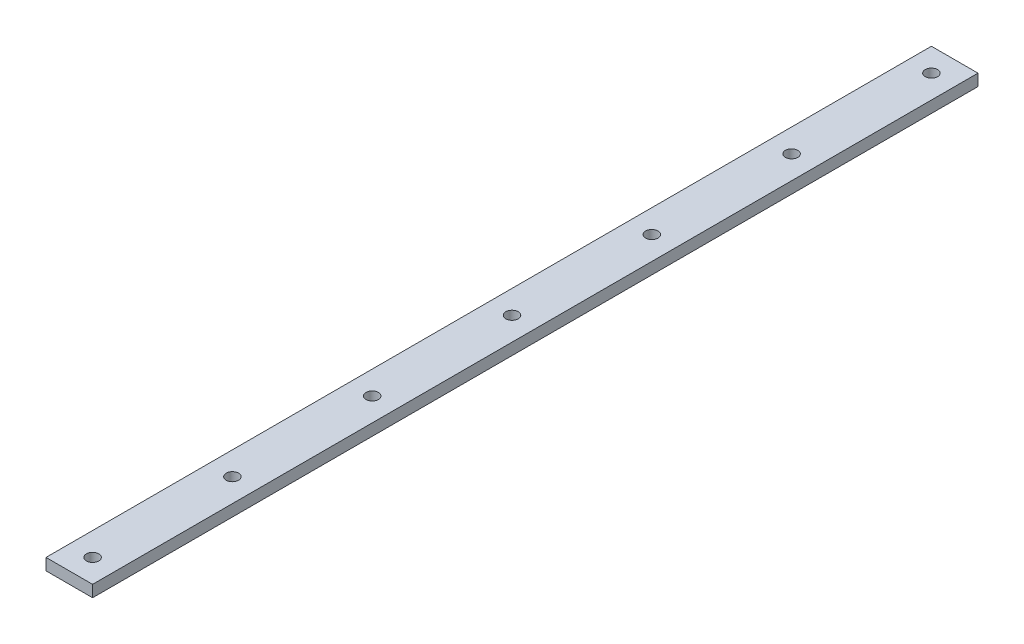
ISO-10303-21;
HEADER;
FILE_DESCRIPTION(('STEP AP214'),'2;1');
FILE_NAME('part.step','',(''),(''),'','','');
FILE_SCHEMA(('AUTOMOTIVE_DESIGN { 1 0 10303 214 1 1 1 1 }'));
ENDSEC;
DATA;
#1=APPLICATION_CONTEXT('core data for automotive mechanical design processes');
#2=APPLICATION_PROTOCOL_DEFINITION('international standard','automotive_design',2000,#1);
#3=PRODUCT_CONTEXT('',#1,'mechanical');
#4=PRODUCT('Part','Part','',(#3));
#5=PRODUCT_RELATED_PRODUCT_CATEGORY('part','',(#4));
#6=PRODUCT_DEFINITION_FORMATION('','',#4);
#7=PRODUCT_DEFINITION_CONTEXT('part definition',#1,'design');
#8=PRODUCT_DEFINITION('design','',#6,#7);
#9=PRODUCT_DEFINITION_SHAPE('','',#8);
#10=(LENGTH_UNIT() NAMED_UNIT(*) SI_UNIT(.MILLI.,.METRE.));
#11=(NAMED_UNIT(*) PLANE_ANGLE_UNIT() SI_UNIT($,.RADIAN.));
#12=(NAMED_UNIT(*) SI_UNIT($,.STERADIAN.) SOLID_ANGLE_UNIT());
#13=UNCERTAINTY_MEASURE_WITH_UNIT(LENGTH_MEASURE(1.E-05),#10,'distance_accuracy_value','');
#14=(GEOMETRIC_REPRESENTATION_CONTEXT(3) GLOBAL_UNCERTAINTY_ASSIGNED_CONTEXT((#13)) GLOBAL_UNIT_ASSIGNED_CONTEXT((#10,
#11,#12)) REPRESENTATION_CONTEXT('',''));
#15=CARTESIAN_POINT('',(0.,0.,0.));
#16=DIRECTION('',(0.,0.,1.));
#17=DIRECTION('',(1.,0.,0.));
#18=AXIS2_PLACEMENT_3D('',#15,#16,#17);
#19=CARTESIAN_POINT('',(0.,6.35,0.));
#20=DIRECTION('',(-1.,0.,0.));
#21=DIRECTION('',(0.,0.,1.));
#22=AXIS2_PLACEMENT_3D('',#19,#20,#21);
#23=PLANE('',#22);
#24=DIRECTION('',(0.,0.,-1.));
#25=VECTOR('',#24,1.);
#26=CARTESIAN_POINT('',(0.,0.,0.));
#27=LINE('',#26,#25);
#28=CARTESIAN_POINT('',(0.,0.,0.));
#29=VERTEX_POINT('',#28);
#30=CARTESIAN_POINT('',(0.,0.,-482.6));
#31=VERTEX_POINT('',#30);
#32=EDGE_CURVE('E111',#29,#31,#27,.T.);
#33=ORIENTED_EDGE('',*,*,#32,.T.);
#34=DIRECTION('',(0.,-1.,0.));
#35=VECTOR('',#34,1.);
#36=CARTESIAN_POINT('',(0.,6.35,-482.6));
#37=LINE('',#36,#35);
#38=CARTESIAN_POINT('',(0.,6.35,-482.6));
#39=VERTEX_POINT('',#38);
#40=EDGE_CURVE('E11',#39,#31,#37,.T.);
#41=ORIENTED_EDGE('',*,*,#40,.F.);
#42=DIRECTION('',(0.,0.,-1.));
#43=VECTOR('',#42,1.);
#44=CARTESIAN_POINT('',(0.,6.35,0.));
#45=LINE('',#44,#43);
#46=CARTESIAN_POINT('',(0.,6.35,0.));
#47=VERTEX_POINT('',#46);
#48=EDGE_CURVE('E94',#47,#39,#45,.T.);
#49=ORIENTED_EDGE('',*,*,#48,.F.);
#50=DIRECTION('',(0.,-1.,0.));
#51=VECTOR('',#50,1.);
#52=CARTESIAN_POINT('',(0.,6.35,0.));
#53=LINE('',#52,#51);
#54=EDGE_CURVE('E107',#47,#29,#53,.T.);
#55=ORIENTED_EDGE('',*,*,#54,.T.);
#56=EDGE_LOOP('',(#33,#41,#49,#55));
#57=FACE_BOUND('',#56,.T.);
#58=ADVANCED_FACE('F39',(#57),#23,.F.);
#59=CARTESIAN_POINT('',(0.,6.35,-482.6));
#60=DIRECTION('',(0.,0.,1.));
#61=DIRECTION('',(1.,0.,0.));
#62=AXIS2_PLACEMENT_3D('',#59,#60,#61);
#63=PLANE('',#62);
#64=DIRECTION('',(-1.,0.,0.));
#65=VECTOR('',#64,1.);
#66=CARTESIAN_POINT('',(0.,0.,-482.6));
#67=LINE('',#66,#65);
#68=CARTESIAN_POINT('',(-25.4,0.,-482.6));
#69=VERTEX_POINT('',#68);
#70=EDGE_CURVE('E99',#31,#69,#67,.T.);
#71=ORIENTED_EDGE('',*,*,#70,.T.);
#72=DIRECTION('',(0.,-1.,0.));
#73=VECTOR('',#72,1.);
#74=CARTESIAN_POINT('',(-25.4,6.35,-482.6));
#75=LINE('',#74,#73);
#76=CARTESIAN_POINT('',(-25.4,6.35,-482.6));
#77=VERTEX_POINT('',#76);
#78=EDGE_CURVE('E48',#77,#69,#75,.T.);
#79=ORIENTED_EDGE('',*,*,#78,.F.);
#80=DIRECTION('',(-1.,0.,0.));
#81=VECTOR('',#80,1.);
#82=CARTESIAN_POINT('',(0.,6.35,-482.6));
#83=LINE('',#82,#81);
#84=EDGE_CURVE('E89',#39,#77,#83,.T.);
#85=ORIENTED_EDGE('',*,*,#84,.F.);
#86=ORIENTED_EDGE('',*,*,#40,.T.);
#87=EDGE_LOOP('',(#71,#79,#85,#86));
#88=FACE_BOUND('',#87,.T.);
#89=ADVANCED_FACE('F98',(#88),#63,.F.);
#90=CARTESIAN_POINT('',(-25.4,6.35,0.));
#91=DIRECTION('',(1.,0.,0.));
#92=DIRECTION('',(0.,0.,-1.));
#93=AXIS2_PLACEMENT_3D('',#90,#91,#92);
#94=PLANE('',#93);
#95=DIRECTION('',(0.,0.,1.));
#96=VECTOR('',#95,1.);
#97=CARTESIAN_POINT('',(-25.4,0.,0.));
#98=LINE('',#97,#96);
#99=CARTESIAN_POINT('',(-25.4,0.,0.));
#100=VERTEX_POINT('',#99);
#101=EDGE_CURVE('E74',#69,#100,#98,.T.);
#102=ORIENTED_EDGE('',*,*,#101,.T.);
#103=DIRECTION('',(0.,-1.,0.));
#104=VECTOR('',#103,1.);
#105=CARTESIAN_POINT('',(-25.4,6.35,0.));
#106=LINE('',#105,#104);
#107=CARTESIAN_POINT('',(-25.4,6.35,0.));
#108=VERTEX_POINT('',#107);
#109=EDGE_CURVE('E101',#108,#100,#106,.T.);
#110=ORIENTED_EDGE('',*,*,#109,.F.);
#111=DIRECTION('',(0.,0.,1.));
#112=VECTOR('',#111,1.);
#113=CARTESIAN_POINT('',(-25.4,6.35,0.));
#114=LINE('',#113,#112);
#115=EDGE_CURVE('E92',#77,#108,#114,.T.);
#116=ORIENTED_EDGE('',*,*,#115,.F.);
#117=ORIENTED_EDGE('',*,*,#78,.T.);
#118=EDGE_LOOP('',(#102,#110,#116,#117));
#119=FACE_BOUND('',#118,.T.);
#120=ADVANCED_FACE('F102',(#119),#94,.F.);
#121=CARTESIAN_POINT('',(0.,6.35,0.));
#122=DIRECTION('',(0.,0.,-1.));
#123=DIRECTION('',(-1.,0.,0.));
#124=AXIS2_PLACEMENT_3D('',#121,#122,#123);
#125=PLANE('',#124);
#126=DIRECTION('',(1.,0.,0.));
#127=VECTOR('',#126,1.);
#128=CARTESIAN_POINT('',(0.,0.,0.));
#129=LINE('',#128,#127);
#130=EDGE_CURVE('E80',#100,#29,#129,.T.);
#131=ORIENTED_EDGE('',*,*,#130,.T.);
#132=ORIENTED_EDGE('',*,*,#54,.F.);
#133=DIRECTION('',(1.,0.,0.));
#134=VECTOR('',#133,1.);
#135=CARTESIAN_POINT('',(0.,6.35,0.));
#136=LINE('',#135,#134);
#137=EDGE_CURVE('E56',#108,#47,#136,.T.);
#138=ORIENTED_EDGE('',*,*,#137,.F.);
#139=ORIENTED_EDGE('',*,*,#109,.T.);
#140=EDGE_LOOP('',(#131,#132,#138,#139));
#141=FACE_BOUND('',#140,.T.);
#142=ADVANCED_FACE('F121',(#141),#125,.F.);
#143=CARTESIAN_POINT('',(0.,6.35,0.));
#144=DIRECTION('',(0.,1.,0.));
#145=DIRECTION('',(0.,0.,1.));
#146=AXIS2_PLACEMENT_3D('',#143,#144,#145);
#147=PLANE('',#146);
#148=CARTESIAN_POINT('',(-12.7,6.35,-12.7));
#149=DIRECTION('',(0.,1.,0.));
#150=DIRECTION('',(0.,0.,1.));
#151=AXIS2_PLACEMENT_3D('',#148,#149,#150);
#152=CIRCLE('',#151,3.3782);
#153=CARTESIAN_POINT('',(-12.7,6.35,-9.3218));
#154=VERTEX_POINT('',#153);
#155=EDGE_CURVE('E171',#154,#154,#152,.T.);
#156=ORIENTED_EDGE('',*,*,#155,.F.);
#157=EDGE_LOOP('',(#156));
#158=FACE_BOUND('',#157,.T.);
#159=CARTESIAN_POINT('',(-12.7000000000003,6.35,-88.9));
#160=DIRECTION('',(0.,1.,0.));
#161=DIRECTION('',(0.,0.,1.));
#162=AXIS2_PLACEMENT_3D('',#159,#160,#161);
#163=CIRCLE('',#162,3.3782);
#164=CARTESIAN_POINT('',(-12.7000000000003,6.35,-85.5218));
#165=VERTEX_POINT('',#164);
#166=EDGE_CURVE('E165',#165,#165,#163,.T.);
#167=ORIENTED_EDGE('',*,*,#166,.F.);
#168=EDGE_LOOP('',(#167));
#169=FACE_BOUND('',#168,.T.);
#170=CARTESIAN_POINT('',(-12.7000000000005,6.35,-165.1));
#171=DIRECTION('',(0.,1.,0.));
#172=DIRECTION('',(0.,0.,1.));
#173=AXIS2_PLACEMENT_3D('',#170,#171,#172);
#174=CIRCLE('',#173,3.3782);
#175=CARTESIAN_POINT('',(-12.7000000000005,6.35,-161.7218));
#176=VERTEX_POINT('',#175);
#177=EDGE_CURVE('E159',#176,#176,#174,.T.);
#178=ORIENTED_EDGE('',*,*,#177,.F.);
#179=EDGE_LOOP('',(#178));
#180=FACE_BOUND('',#179,.T.);
#181=CARTESIAN_POINT('',(-12.7000000000008,6.35,-241.3));
#182=DIRECTION('',(0.,1.,0.));
#183=DIRECTION('',(0.,0.,1.));
#184=AXIS2_PLACEMENT_3D('',#181,#182,#183);
#185=CIRCLE('',#184,3.3782);
#186=CARTESIAN_POINT('',(-12.7000000000008,6.35,-237.9218));
#187=VERTEX_POINT('',#186);
#188=EDGE_CURVE('E153',#187,#187,#185,.T.);
#189=ORIENTED_EDGE('',*,*,#188,.F.);
#190=EDGE_LOOP('',(#189));
#191=FACE_BOUND('',#190,.T.);
#192=CARTESIAN_POINT('',(-12.700000000001,6.35,-317.5));
#193=DIRECTION('',(0.,1.,0.));
#194=DIRECTION('',(0.,0.,1.));
#195=AXIS2_PLACEMENT_3D('',#192,#193,#194);
#196=CIRCLE('',#195,3.3782);
#197=CARTESIAN_POINT('',(-12.700000000001,6.35,-314.1218));
#198=VERTEX_POINT('',#197);
#199=EDGE_CURVE('E146',#198,#198,#196,.T.);
#200=ORIENTED_EDGE('',*,*,#199,.F.);
#201=EDGE_LOOP('',(#200));
#202=FACE_BOUND('',#201,.T.);
#203=CARTESIAN_POINT('',(-12.7000000000013,6.35,-393.7));
#204=DIRECTION('',(0.,1.,0.));
#205=DIRECTION('',(0.,0.,1.));
#206=AXIS2_PLACEMENT_3D('',#203,#204,#205);
#207=CIRCLE('',#206,3.3782);
#208=CARTESIAN_POINT('',(-12.7000000000013,6.35,-390.3218));
#209=VERTEX_POINT('',#208);
#210=EDGE_CURVE('E138',#209,#209,#207,.T.);
#211=ORIENTED_EDGE('',*,*,#210,.F.);
#212=EDGE_LOOP('',(#211));
#213=FACE_BOUND('',#212,.T.);
#214=CARTESIAN_POINT('',(-12.7000000000017,6.35,-469.9));
#215=DIRECTION('',(0.,1.,0.));
#216=DIRECTION('',(0.,0.,1.));
#217=AXIS2_PLACEMENT_3D('',#214,#215,#216);
#218=CIRCLE('',#217,3.3782);
#219=CARTESIAN_POINT('',(-12.7000000000017,6.35,-466.5218));
#220=VERTEX_POINT('',#219);
#221=EDGE_CURVE('E131',#220,#220,#218,.T.);
#222=ORIENTED_EDGE('',*,*,#221,.F.);
#223=EDGE_LOOP('',(#222));
#224=FACE_BOUND('',#223,.T.);
#225=ORIENTED_EDGE('',*,*,#48,.T.);
#226=ORIENTED_EDGE('',*,*,#84,.T.);
#227=ORIENTED_EDGE('',*,*,#115,.T.);
#228=ORIENTED_EDGE('',*,*,#137,.T.);
#229=EDGE_LOOP('',(#225,#226,#227,#228));
#230=FACE_BOUND('',#229,.T.);
#231=ADVANCED_FACE('F90',(#158,#169,#180,#191,#202,#213,#224,#230),#147,.T.);
#232=CARTESIAN_POINT('',(0.,0.,0.));
#233=DIRECTION('',(0.,1.,0.));
#234=DIRECTION('',(0.,0.,1.));
#235=AXIS2_PLACEMENT_3D('',#232,#233,#234);
#236=PLANE('',#235);
#237=CARTESIAN_POINT('',(-12.7,0.,-12.7));
#238=DIRECTION('',(0.,1.,0.));
#239=DIRECTION('',(0.,0.,1.));
#240=AXIS2_PLACEMENT_3D('',#237,#238,#239);
#241=CIRCLE('',#240,3.3782);
#242=CARTESIAN_POINT('',(-12.7,0.,-9.3218));
#243=VERTEX_POINT('',#242);
#244=EDGE_CURVE('E168',#243,#243,#241,.T.);
#245=ORIENTED_EDGE('',*,*,#244,.T.);
#246=EDGE_LOOP('',(#245));
#247=FACE_BOUND('',#246,.T.);
#248=CARTESIAN_POINT('',(-12.7000000000003,0.,-88.9));
#249=DIRECTION('',(0.,1.,0.));
#250=DIRECTION('',(0.,0.,1.));
#251=AXIS2_PLACEMENT_3D('',#248,#249,#250);
#252=CIRCLE('',#251,3.3782);
#253=CARTESIAN_POINT('',(-12.7000000000003,0.,-85.5218));
#254=VERTEX_POINT('',#253);
#255=EDGE_CURVE('E162',#254,#254,#252,.T.);
#256=ORIENTED_EDGE('',*,*,#255,.T.);
#257=EDGE_LOOP('',(#256));
#258=FACE_BOUND('',#257,.T.);
#259=CARTESIAN_POINT('',(-12.7000000000005,0.,-165.1));
#260=DIRECTION('',(0.,1.,0.));
#261=DIRECTION('',(0.,0.,1.));
#262=AXIS2_PLACEMENT_3D('',#259,#260,#261);
#263=CIRCLE('',#262,3.3782);
#264=CARTESIAN_POINT('',(-12.7000000000005,0.,-161.7218));
#265=VERTEX_POINT('',#264);
#266=EDGE_CURVE('E156',#265,#265,#263,.T.);
#267=ORIENTED_EDGE('',*,*,#266,.T.);
#268=EDGE_LOOP('',(#267));
#269=FACE_BOUND('',#268,.T.);
#270=CARTESIAN_POINT('',(-12.7000000000008,0.,-241.3));
#271=DIRECTION('',(0.,1.,0.));
#272=DIRECTION('',(0.,0.,1.));
#273=AXIS2_PLACEMENT_3D('',#270,#271,#272);
#274=CIRCLE('',#273,3.3782);
#275=CARTESIAN_POINT('',(-12.7000000000008,0.,-237.9218));
#276=VERTEX_POINT('',#275);
#277=EDGE_CURVE('E150',#276,#276,#274,.T.);
#278=ORIENTED_EDGE('',*,*,#277,.T.);
#279=EDGE_LOOP('',(#278));
#280=FACE_BOUND('',#279,.T.);
#281=CARTESIAN_POINT('',(-12.700000000001,0.,-317.5));
#282=DIRECTION('',(0.,1.,0.));
#283=DIRECTION('',(0.,0.,1.));
#284=AXIS2_PLACEMENT_3D('',#281,#282,#283);
#285=CIRCLE('',#284,3.3782);
#286=CARTESIAN_POINT('',(-12.700000000001,0.,-314.1218));
#287=VERTEX_POINT('',#286);
#288=EDGE_CURVE('E142',#287,#287,#285,.T.);
#289=ORIENTED_EDGE('',*,*,#288,.T.);
#290=EDGE_LOOP('',(#289));
#291=FACE_BOUND('',#290,.T.);
#292=CARTESIAN_POINT('',(-12.7000000000013,0.,-393.7));
#293=DIRECTION('',(0.,1.,0.));
#294=DIRECTION('',(0.,0.,1.));
#295=AXIS2_PLACEMENT_3D('',#292,#293,#294);
#296=CIRCLE('',#295,3.3782);
#297=CARTESIAN_POINT('',(-12.7000000000013,0.,-390.3218));
#298=VERTEX_POINT('',#297);
#299=EDGE_CURVE('E135',#298,#298,#296,.T.);
#300=ORIENTED_EDGE('',*,*,#299,.T.);
#301=EDGE_LOOP('',(#300));
#302=FACE_BOUND('',#301,.T.);
#303=CARTESIAN_POINT('',(-12.7000000000017,0.,-469.9));
#304=DIRECTION('',(0.,1.,0.));
#305=DIRECTION('',(0.,0.,1.));
#306=AXIS2_PLACEMENT_3D('',#303,#304,#305);
#307=CIRCLE('',#306,3.3782);
#308=CARTESIAN_POINT('',(-12.7000000000017,0.,-466.5218));
#309=VERTEX_POINT('',#308);
#310=EDGE_CURVE('E115',#309,#309,#307,.T.);
#311=ORIENTED_EDGE('',*,*,#310,.T.);
#312=EDGE_LOOP('',(#311));
#313=FACE_BOUND('',#312,.T.);
#314=ORIENTED_EDGE('',*,*,#32,.F.);
#315=ORIENTED_EDGE('',*,*,#130,.F.);
#316=ORIENTED_EDGE('',*,*,#101,.F.);
#317=ORIENTED_EDGE('',*,*,#70,.F.);
#318=EDGE_LOOP('',(#314,#315,#316,#317));
#319=FACE_BOUND('',#318,.T.);
#320=ADVANCED_FACE('F124',(#247,#258,#269,#280,#291,#302,#313,#319),#236,.F.);
#321=CARTESIAN_POINT('',(-12.7000000000017,6.35,-469.9));
#322=DIRECTION('',(0.,1.,0.));
#323=DIRECTION('',(0.,0.,1.));
#324=AXIS2_PLACEMENT_3D('',#321,#322,#323);
#325=CYLINDRICAL_SURFACE('',#324,3.3782);
#326=ORIENTED_EDGE('',*,*,#310,.F.);
#327=EDGE_LOOP('',(#326));
#328=FACE_BOUND('',#327,.T.);
#329=ORIENTED_EDGE('',*,*,#221,.T.);
#330=EDGE_LOOP('',(#329));
#331=FACE_BOUND('',#330,.T.);
#332=ADVANCED_FACE('F192',(#328,#331),#325,.F.);
#333=CARTESIAN_POINT('',(-12.7000000000013,6.35,-393.7));
#334=DIRECTION('',(0.,1.,0.));
#335=DIRECTION('',(0.,0.,1.));
#336=AXIS2_PLACEMENT_3D('',#333,#334,#335);
#337=CYLINDRICAL_SURFACE('',#336,3.3782);
#338=ORIENTED_EDGE('',*,*,#299,.F.);
#339=EDGE_LOOP('',(#338));
#340=FACE_BOUND('',#339,.T.);
#341=ORIENTED_EDGE('',*,*,#210,.T.);
#342=EDGE_LOOP('',(#341));
#343=FACE_BOUND('',#342,.T.);
#344=ADVANCED_FACE('F194',(#340,#343),#337,.F.);
#345=CARTESIAN_POINT('',(-12.700000000001,6.35,-317.5));
#346=DIRECTION('',(0.,1.,0.));
#347=DIRECTION('',(0.,0.,1.));
#348=AXIS2_PLACEMENT_3D('',#345,#346,#347);
#349=CYLINDRICAL_SURFACE('',#348,3.3782);
#350=ORIENTED_EDGE('',*,*,#288,.F.);
#351=EDGE_LOOP('',(#350));
#352=FACE_BOUND('',#351,.T.);
#353=ORIENTED_EDGE('',*,*,#199,.T.);
#354=EDGE_LOOP('',(#353));
#355=FACE_BOUND('',#354,.T.);
#356=ADVANCED_FACE('F201',(#352,#355),#349,.F.);
#357=CARTESIAN_POINT('',(-12.7000000000008,6.35,-241.3));
#358=DIRECTION('',(0.,1.,0.));
#359=DIRECTION('',(0.,0.,1.));
#360=AXIS2_PLACEMENT_3D('',#357,#358,#359);
#361=CYLINDRICAL_SURFACE('',#360,3.3782);
#362=ORIENTED_EDGE('',*,*,#277,.F.);
#363=EDGE_LOOP('',(#362));
#364=FACE_BOUND('',#363,.T.);
#365=ORIENTED_EDGE('',*,*,#188,.T.);
#366=EDGE_LOOP('',(#365));
#367=FACE_BOUND('',#366,.T.);
#368=ADVANCED_FACE('F268',(#364,#367),#361,.F.);
#369=CARTESIAN_POINT('',(-12.7000000000005,6.35,-165.1));
#370=DIRECTION('',(0.,1.,0.));
#371=DIRECTION('',(0.,0.,1.));
#372=AXIS2_PLACEMENT_3D('',#369,#370,#371);
#373=CYLINDRICAL_SURFACE('',#372,3.3782);
#374=ORIENTED_EDGE('',*,*,#266,.F.);
#375=EDGE_LOOP('',(#374));
#376=FACE_BOUND('',#375,.T.);
#377=ORIENTED_EDGE('',*,*,#177,.T.);
#378=EDGE_LOOP('',(#377));
#379=FACE_BOUND('',#378,.T.);
#380=ADVANCED_FACE('F277',(#376,#379),#373,.F.);
#381=CARTESIAN_POINT('',(-12.7000000000003,6.35,-88.9));
#382=DIRECTION('',(0.,1.,0.));
#383=DIRECTION('',(0.,0.,1.));
#384=AXIS2_PLACEMENT_3D('',#381,#382,#383);
#385=CYLINDRICAL_SURFACE('',#384,3.3782);
#386=ORIENTED_EDGE('',*,*,#255,.F.);
#387=EDGE_LOOP('',(#386));
#388=FACE_BOUND('',#387,.T.);
#389=ORIENTED_EDGE('',*,*,#166,.T.);
#390=EDGE_LOOP('',(#389));
#391=FACE_BOUND('',#390,.T.);
#392=ADVANCED_FACE('F286',(#388,#391),#385,.F.);
#393=CARTESIAN_POINT('',(-12.7,6.35,-12.7));
#394=DIRECTION('',(0.,1.,0.));
#395=DIRECTION('',(0.,0.,1.));
#396=AXIS2_PLACEMENT_3D('',#393,#394,#395);
#397=CYLINDRICAL_SURFACE('',#396,3.3782);
#398=ORIENTED_EDGE('',*,*,#244,.F.);
#399=EDGE_LOOP('',(#398));
#400=FACE_BOUND('',#399,.T.);
#401=ORIENTED_EDGE('',*,*,#155,.T.);
#402=EDGE_LOOP('',(#401));
#403=FACE_BOUND('',#402,.T.);
#404=ADVANCED_FACE('F175',(#400,#403),#397,.F.);
#405=CLOSED_SHELL('',(#58,#89,#120,#142,#231,#320,#332,#344,#356,#368,#380,#392,#404));
#406=MANIFOLD_SOLID_BREP('B2',#405);
#407=ADVANCED_BREP_SHAPE_REPRESENTATION('',(#18,#406),#14);
#408=SHAPE_DEFINITION_REPRESENTATION(#9,#407);
ENDSEC;
END-ISO-10303-21;
